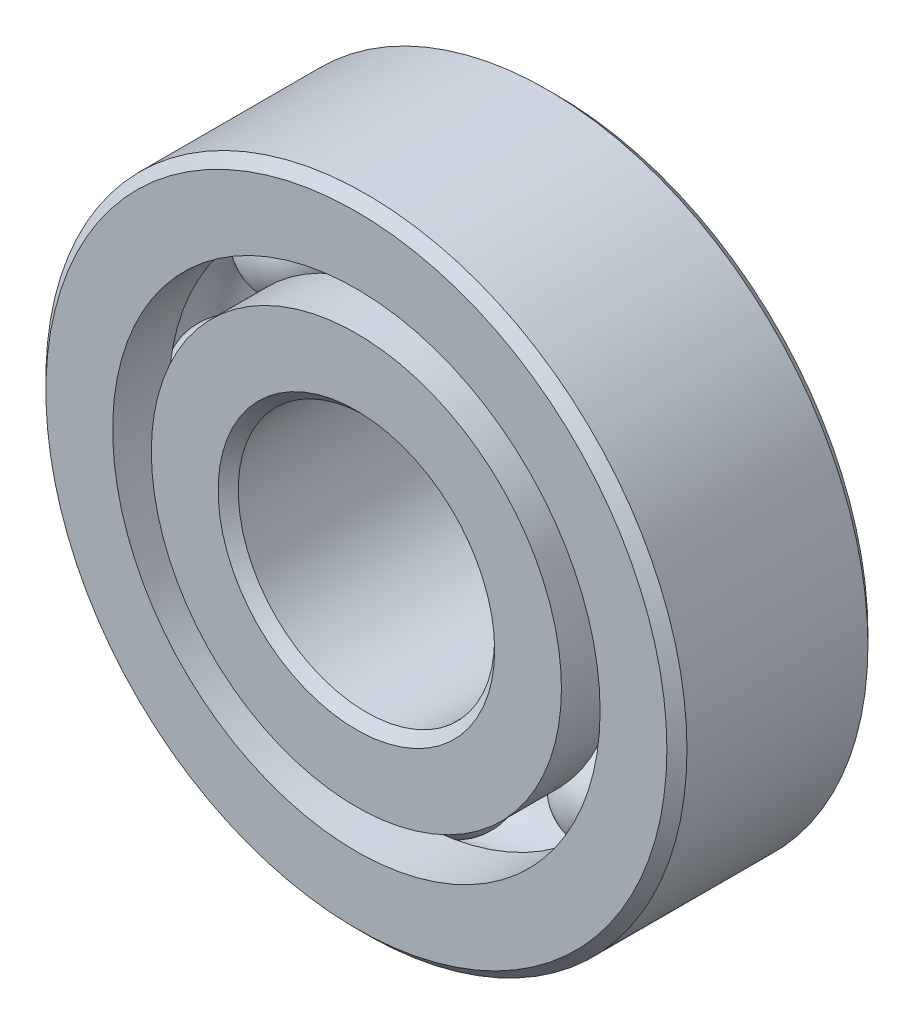
ISO-10303-21;
HEADER;
FILE_DESCRIPTION(('STEP AP214'),'2;1');
FILE_NAME('part.step','',(''),(''),'','','');
FILE_SCHEMA(('AUTOMOTIVE_DESIGN { 1 0 10303 214 1 1 1 1 }'));
ENDSEC;
DATA;
#1=APPLICATION_CONTEXT('core data for automotive mechanical design processes');
#2=APPLICATION_PROTOCOL_DEFINITION('international standard','automotive_design',2000,#1);
#3=PRODUCT_CONTEXT('',#1,'mechanical');
#4=PRODUCT('Part','Part','',(#3));
#5=PRODUCT_RELATED_PRODUCT_CATEGORY('part','',(#4));
#6=PRODUCT_DEFINITION_FORMATION('','',#4);
#7=PRODUCT_DEFINITION_CONTEXT('part definition',#1,'design');
#8=PRODUCT_DEFINITION('design','',#6,#7);
#9=PRODUCT_DEFINITION_SHAPE('','',#8);
#10=(LENGTH_UNIT() NAMED_UNIT(*) SI_UNIT(.MILLI.,.METRE.));
#11=(NAMED_UNIT(*) PLANE_ANGLE_UNIT() SI_UNIT($,.RADIAN.));
#12=(NAMED_UNIT(*) SI_UNIT($,.STERADIAN.) SOLID_ANGLE_UNIT());
#13=UNCERTAINTY_MEASURE_WITH_UNIT(LENGTH_MEASURE(1.E-05),#10,'distance_accuracy_value','');
#14=(GEOMETRIC_REPRESENTATION_CONTEXT(3) GLOBAL_UNCERTAINTY_ASSIGNED_CONTEXT((#13)) GLOBAL_UNIT_ASSIGNED_CONTEXT((#10,
#11,#12)) REPRESENTATION_CONTEXT('',''));
#15=CARTESIAN_POINT('',(0.,0.,0.));
#16=DIRECTION('',(0.,0.,1.));
#17=DIRECTION('',(1.,0.,0.));
#18=AXIS2_PLACEMENT_3D('',#15,#16,#17);
#19=CARTESIAN_POINT('',(-3.92886205296771,3.9288620529678,0.));
#20=DIRECTION('',(0.,0.,1.));
#21=DIRECTION('',(-0.707106781186539,0.707106781186556,0.));
#22=AXIS2_PLACEMENT_3D('',#19,#20,#21);
#23=SPHERICAL_SURFACE('',#22,1.20554465033679);
#24=CARTESIAN_POINT('',(-3.92886205296771,3.9288620529678,1.20554465033679));
#25=VERTEX_POINT('',#24);
#26=VERTEX_LOOP('',#25);
#27=FACE_BOUND('',#26,.T.);
#28=ADVANCED_FACE('F42',(#27),#23,.T.);
#29=CLOSED_SHELL('',(#28));
#30=MANIFOLD_SOLID_BREP('B2',#29);
#31=CARTESIAN_POINT('',(-5.55625,0.,0.));
#32=DIRECTION('',(0.,0.,1.));
#33=DIRECTION('',(-1.,0.,0.));
#34=AXIS2_PLACEMENT_3D('',#31,#32,#33);
#35=SPHERICAL_SURFACE('',#34,1.20554465033679);
#36=CARTESIAN_POINT('',(-5.55625,0.,1.20554465033679));
#37=VERTEX_POINT('',#36);
#38=VERTEX_LOOP('',#37);
#39=FACE_BOUND('',#38,.T.);
#40=ADVANCED_FACE('F65',(#39),#35,.T.);
#41=CLOSED_SHELL('',(#40));
#42=MANIFOLD_SOLID_BREP('B6',#41);
#43=CARTESIAN_POINT('',(-3.92886205296779,-3.92886205296772,0.));
#44=DIRECTION('',(0.,0.,1.));
#45=DIRECTION('',(-0.707106781186554,-0.707106781186541,0.));
#46=AXIS2_PLACEMENT_3D('',#43,#44,#45);
#47=SPHERICAL_SURFACE('',#46,1.20554465033679);
#48=CARTESIAN_POINT('',(-3.92886205296779,-3.92886205296772,1.20554465033679));
#49=VERTEX_POINT('',#48);
#50=VERTEX_LOOP('',#49);
#51=FACE_BOUND('',#50,.T.);
#52=ADVANCED_FACE('F88',(#51),#47,.T.);
#53=CLOSED_SHELL('',(#52));
#54=MANIFOLD_SOLID_BREP('B38',#53);
#55=CARTESIAN_POINT('',(0.,-5.55625,0.));
#56=DIRECTION('',(0.,0.,1.));
#57=DIRECTION('',(0.,-1.,0.));
#58=AXIS2_PLACEMENT_3D('',#55,#56,#57);
#59=SPHERICAL_SURFACE('',#58,1.20554465033679);
#60=CARTESIAN_POINT('',(0.,-5.55625,1.20554465033679));
#61=VERTEX_POINT('',#60);
#62=VERTEX_LOOP('',#61);
#63=FACE_BOUND('',#62,.T.);
#64=ADVANCED_FACE('F111',(#63),#59,.T.);
#65=CLOSED_SHELL('',(#64));
#66=MANIFOLD_SOLID_BREP('B61',#65);
#67=CARTESIAN_POINT('',(3.92886205296773,-3.92886205296777,0.));
#68=DIRECTION('',(0.,0.,1.));
#69=DIRECTION('',(0.707106781186544,-0.707106781186551,0.));
#70=AXIS2_PLACEMENT_3D('',#67,#68,#69);
#71=SPHERICAL_SURFACE('',#70,1.20554465033679);
#72=CARTESIAN_POINT('',(3.92886205296773,-3.92886205296777,1.20554465033679));
#73=VERTEX_POINT('',#72);
#74=VERTEX_LOOP('',#73);
#75=FACE_BOUND('',#74,.T.);
#76=ADVANCED_FACE('F134',(#75),#71,.T.);
#77=CLOSED_SHELL('',(#76));
#78=MANIFOLD_SOLID_BREP('B84',#77);
#79=CARTESIAN_POINT('',(5.55625,0.,0.));
#80=DIRECTION('',(0.,0.,1.));
#81=DIRECTION('',(1.,0.,0.));
#82=AXIS2_PLACEMENT_3D('',#79,#80,#81);
#83=SPHERICAL_SURFACE('',#82,1.20554465033679);
#84=CARTESIAN_POINT('',(5.55625,0.,1.20554465033679));
#85=VERTEX_POINT('',#84);
#86=VERTEX_LOOP('',#85);
#87=FACE_BOUND('',#86,.T.);
#88=ADVANCED_FACE('F157',(#87),#83,.T.);
#89=CLOSED_SHELL('',(#88));
#90=MANIFOLD_SOLID_BREP('B107',#89);
#91=CARTESIAN_POINT('',(3.92886205296776,3.92886205296775,0.));
#92=DIRECTION('',(0.,0.,1.));
#93=DIRECTION('',(0.707106781186549,0.707106781186546,0.));
#94=AXIS2_PLACEMENT_3D('',#91,#92,#93);
#95=SPHERICAL_SURFACE('',#94,1.20554465033679);
#96=CARTESIAN_POINT('',(3.92886205296776,3.92886205296775,1.20554465033679));
#97=VERTEX_POINT('',#96);
#98=VERTEX_LOOP('',#97);
#99=FACE_BOUND('',#98,.T.);
#100=ADVANCED_FACE('F180',(#99),#95,.T.);
#101=CLOSED_SHELL('',(#100));
#102=MANIFOLD_SOLID_BREP('B130',#101);
#103=CARTESIAN_POINT('',(0.,5.55625,0.));
#104=DIRECTION('',(0.,0.,1.));
#105=DIRECTION('',(0.,1.,0.));
#106=AXIS2_PLACEMENT_3D('',#103,#104,#105);
#107=SPHERICAL_SURFACE('',#106,1.20554465033679);
#108=CARTESIAN_POINT('',(0.,5.55625,1.20554465033679));
#109=VERTEX_POINT('',#108);
#110=VERTEX_LOOP('',#109);
#111=FACE_BOUND('',#110,.T.);
#112=ADVANCED_FACE('F205',(#111),#107,.T.);
#113=CLOSED_SHELL('',(#112));
#114=MANIFOLD_SOLID_BREP('B153',#113);
#115=CARTESIAN_POINT('',(0.,5.07727857142857,2.4892));
#116=DIRECTION('',(0.,0.,-1.));
#117=DIRECTION('',(-1.,0.,0.));
#118=AXIS2_PLACEMENT_3D('',#115,#116,#117);
#119=PLANE('',#118);
#120=CARTESIAN_POINT('',(0.,0.,2.4892));
#121=DIRECTION('',(0.,0.,1.));
#122=DIRECTION('',(1.,0.,0.));
#123=AXIS2_PLACEMENT_3D('',#120,#121,#122);
#124=CIRCLE('',#123,3.42392);
#125=CARTESIAN_POINT('',(3.42392,0.,2.4892));
#126=VERTEX_POINT('',#125);
#127=EDGE_CURVE('E255',#126,#126,#124,.T.);
#128=ORIENTED_EDGE('',*,*,#127,.F.);
#129=EDGE_LOOP('',(#128));
#130=FACE_BOUND('',#129,.T.);
#131=CARTESIAN_POINT('',(0.,0.,2.4892));
#132=DIRECTION('',(0.,0.,1.));
#133=DIRECTION('',(1.,0.,0.));
#134=AXIS2_PLACEMENT_3D('',#131,#132,#133);
#135=CIRCLE('',#134,5.07727857142857);
#136=CARTESIAN_POINT('',(5.07727857142857,0.,2.4892));
#137=VERTEX_POINT('',#136);
#138=EDGE_CURVE('E204',#137,#137,#135,.T.);
#139=ORIENTED_EDGE('',*,*,#138,.T.);
#140=EDGE_LOOP('',(#139));
#141=FACE_BOUND('',#140,.T.);
#142=ADVANCED_FACE('F227',(#130,#141),#119,.F.);
#143=CARTESIAN_POINT('',(0.,0.,2.4892));
#144=DIRECTION('',(0.,0.,1.));
#145=DIRECTION('',(1.,0.,0.));
#146=AXIS2_PLACEMENT_3D('',#143,#144,#145);
#147=CYLINDRICAL_SURFACE('',#146,5.07727857142857);
#148=ORIENTED_EDGE('',*,*,#138,.F.);
#149=EDGE_LOOP('',(#148));
#150=FACE_BOUND('',#149,.T.);
#151=CARTESIAN_POINT('',(0.,0.,1.10631111111111));
#152=DIRECTION('',(0.,0.,1.));
#153=DIRECTION('',(1.,0.,0.));
#154=AXIS2_PLACEMENT_3D('',#151,#152,#153);
#155=CIRCLE('',#154,5.07727857142857);
#156=CARTESIAN_POINT('',(5.07727857142857,0.,1.10631111111111));
#157=VERTEX_POINT('',#156);
#158=EDGE_CURVE('E233',#157,#157,#155,.T.);
#159=ORIENTED_EDGE('',*,*,#158,.T.);
#160=EDGE_LOOP('',(#159));
#161=FACE_BOUND('',#160,.T.);
#162=ADVANCED_FACE('F262',(#150,#161),#147,.T.);
#163=CARTESIAN_POINT('',(0.,0.,0.));
#164=DIRECTION('',(0.,0.,1.));
#165=DIRECTION('',(1.,0.,0.));
#166=AXIS2_PLACEMENT_3D('',#163,#164,#165);
#167=TOROIDAL_SURFACE('',#166,5.55625,1.20554465033679);
#168=ORIENTED_EDGE('',*,*,#158,.F.);
#169=EDGE_LOOP('',(#168));
#170=FACE_BOUND('',#169,.T.);
#171=CARTESIAN_POINT('',(0.,0.,-1.10631111111112));
#172=DIRECTION('',(0.,0.,1.));
#173=DIRECTION('',(1.,0.,0.));
#174=AXIS2_PLACEMENT_3D('',#171,#172,#173);
#175=CIRCLE('',#174,5.07727857142857);
#176=CARTESIAN_POINT('',(5.07727857142857,0.,-1.10631111111112));
#177=VERTEX_POINT('',#176);
#178=EDGE_CURVE('E237',#177,#177,#175,.T.);
#179=ORIENTED_EDGE('',*,*,#178,.T.);
#180=EDGE_LOOP('',(#179));
#181=FACE_BOUND('',#180,.T.);
#182=ADVANCED_FACE('F266',(#170,#181),#167,.F.);
#183=CARTESIAN_POINT('',(0.,0.,2.4892));
#184=DIRECTION('',(0.,0.,1.));
#185=DIRECTION('',(1.,0.,0.));
#186=AXIS2_PLACEMENT_3D('',#183,#184,#185);
#187=CYLINDRICAL_SURFACE('',#186,5.07727857142857);
#188=ORIENTED_EDGE('',*,*,#178,.F.);
#189=EDGE_LOOP('',(#188));
#190=FACE_BOUND('',#189,.T.);
#191=CARTESIAN_POINT('',(0.,0.,-2.4892));
#192=DIRECTION('',(0.,0.,1.));
#193=DIRECTION('',(1.,0.,0.));
#194=AXIS2_PLACEMENT_3D('',#191,#192,#193);
#195=CIRCLE('',#194,5.07727857142857);
#196=CARTESIAN_POINT('',(5.07727857142857,0.,-2.4892));
#197=VERTEX_POINT('',#196);
#198=EDGE_CURVE('E241',#197,#197,#195,.T.);
#199=ORIENTED_EDGE('',*,*,#198,.T.);
#200=EDGE_LOOP('',(#199));
#201=FACE_BOUND('',#200,.T.);
#202=ADVANCED_FACE('F271',(#190,#201),#187,.T.);
#203=CARTESIAN_POINT('',(0.,3.42392,-2.4892));
#204=DIRECTION('',(0.,0.,1.));
#205=DIRECTION('',(1.,0.,0.));
#206=AXIS2_PLACEMENT_3D('',#203,#204,#205);
#207=PLANE('',#206);
#208=ORIENTED_EDGE('',*,*,#198,.F.);
#209=EDGE_LOOP('',(#208));
#210=FACE_BOUND('',#209,.T.);
#211=CARTESIAN_POINT('',(0.,0.,-2.4892));
#212=DIRECTION('',(0.,0.,1.));
#213=DIRECTION('',(1.,0.,0.));
#214=AXIS2_PLACEMENT_3D('',#211,#212,#213);
#215=CIRCLE('',#214,3.42392);
#216=CARTESIAN_POINT('',(3.42392,0.,-2.4892));
#217=VERTEX_POINT('',#216);
#218=EDGE_CURVE('E246',#217,#217,#215,.T.);
#219=ORIENTED_EDGE('',*,*,#218,.T.);
#220=EDGE_LOOP('',(#219));
#221=FACE_BOUND('',#220,.T.);
#222=ADVANCED_FACE('F277',(#210,#221),#207,.F.);
#223=CARTESIAN_POINT('',(0.,0.,-2.24028));
#224=DIRECTION('',(0.,0.,-1.));
#225=DIRECTION('',(-1.,0.,0.));
#226=AXIS2_PLACEMENT_3D('',#223,#224,#225);
#227=CONICAL_SURFACE('',#226,3.175,0.785398163397453);
#228=ORIENTED_EDGE('',*,*,#218,.F.);
#229=EDGE_LOOP('',(#228));
#230=FACE_BOUND('',#229,.T.);
#231=CARTESIAN_POINT('',(0.,0.,-2.24028));
#232=DIRECTION('',(0.,0.,1.));
#233=DIRECTION('',(1.,0.,0.));
#234=AXIS2_PLACEMENT_3D('',#231,#232,#233);
#235=CIRCLE('',#234,3.175);
#236=CARTESIAN_POINT('',(3.175,0.,-2.24028));
#237=VERTEX_POINT('',#236);
#238=EDGE_CURVE('E249',#237,#237,#235,.T.);
#239=ORIENTED_EDGE('',*,*,#238,.T.);
#240=EDGE_LOOP('',(#239));
#241=FACE_BOUND('',#240,.T.);
#242=ADVANCED_FACE('F281',(#230,#241),#227,.F.);
#243=CARTESIAN_POINT('',(0.,0.,2.4892));
#244=DIRECTION('',(0.,0.,1.));
#245=DIRECTION('',(1.,0.,0.));
#246=AXIS2_PLACEMENT_3D('',#243,#244,#245);
#247=CYLINDRICAL_SURFACE('',#246,3.175);
#248=ORIENTED_EDGE('',*,*,#238,.F.);
#249=EDGE_LOOP('',(#248));
#250=FACE_BOUND('',#249,.T.);
#251=CARTESIAN_POINT('',(0.,0.,2.24028));
#252=DIRECTION('',(0.,0.,1.));
#253=DIRECTION('',(1.,0.,0.));
#254=AXIS2_PLACEMENT_3D('',#251,#252,#253);
#255=CIRCLE('',#254,3.175);
#256=CARTESIAN_POINT('',(3.175,0.,2.24028));
#257=VERTEX_POINT('',#256);
#258=EDGE_CURVE('E252',#257,#257,#255,.T.);
#259=ORIENTED_EDGE('',*,*,#258,.T.);
#260=EDGE_LOOP('',(#259));
#261=FACE_BOUND('',#260,.T.);
#262=ADVANCED_FACE('F285',(#250,#261),#247,.F.);
#263=CARTESIAN_POINT('',(0.,0.,2.4892));
#264=DIRECTION('',(0.,0.,1.));
#265=DIRECTION('',(1.,0.,0.));
#266=AXIS2_PLACEMENT_3D('',#263,#264,#265);
#267=CONICAL_SURFACE('',#266,3.42392,0.785398163397449);
#268=ORIENTED_EDGE('',*,*,#258,.F.);
#269=EDGE_LOOP('',(#268));
#270=FACE_BOUND('',#269,.T.);
#271=ORIENTED_EDGE('',*,*,#127,.T.);
#272=EDGE_LOOP('',(#271));
#273=FACE_BOUND('',#272,.T.);
#274=ADVANCED_FACE('F259',(#270,#273),#267,.F.);
#275=CLOSED_SHELL('',(#142,#162,#182,#202,#222,#242,#262,#274));
#276=MANIFOLD_SOLID_BREP('B176',#275);
#277=CARTESIAN_POINT('',(0.,0.,2.24028));
#278=DIRECTION('',(0.,0.,-1.));
#279=DIRECTION('',(-1.,0.,0.));
#280=AXIS2_PLACEMENT_3D('',#277,#278,#279);
#281=CONICAL_SURFACE('',#280,7.9375,0.785398163397446);
#282=CARTESIAN_POINT('',(0.,0.,2.4892));
#283=DIRECTION('',(0.,0.,1.));
#284=DIRECTION('',(1.,0.,0.));
#285=AXIS2_PLACEMENT_3D('',#282,#283,#284);
#286=CIRCLE('',#285,7.68858);
#287=CARTESIAN_POINT('',(7.68858,0.,2.4892));
#288=VERTEX_POINT('',#287);
#289=EDGE_CURVE('E379',#288,#288,#286,.T.);
#290=ORIENTED_EDGE('',*,*,#289,.F.);
#291=EDGE_LOOP('',(#290));
#292=FACE_BOUND('',#291,.T.);
#293=CARTESIAN_POINT('',(0.,0.,2.24028));
#294=DIRECTION('',(0.,0.,1.));
#295=DIRECTION('',(1.,0.,0.));
#296=AXIS2_PLACEMENT_3D('',#293,#294,#295);
#297=CIRCLE('',#296,7.9375);
#298=CARTESIAN_POINT('',(7.9375,0.,2.24028));
#299=VERTEX_POINT('',#298);
#300=EDGE_CURVE('E226',#299,#299,#297,.T.);
#301=ORIENTED_EDGE('',*,*,#300,.T.);
#302=EDGE_LOOP('',(#301));
#303=FACE_BOUND('',#302,.T.);
#304=ADVANCED_FACE('F351',(#292,#303),#281,.T.);
#305=CARTESIAN_POINT('',(0.,0.,2.4892));
#306=DIRECTION('',(0.,0.,1.));
#307=DIRECTION('',(1.,0.,0.));
#308=AXIS2_PLACEMENT_3D('',#305,#306,#307);
#309=CYLINDRICAL_SURFACE('',#308,7.9375);
#310=ORIENTED_EDGE('',*,*,#300,.F.);
#311=EDGE_LOOP('',(#310));
#312=FACE_BOUND('',#311,.T.);
#313=CARTESIAN_POINT('',(0.,0.,-2.24028));
#314=DIRECTION('',(0.,0.,1.));
#315=DIRECTION('',(1.,0.,0.));
#316=AXIS2_PLACEMENT_3D('',#313,#314,#315);
#317=CIRCLE('',#316,7.9375);
#318=CARTESIAN_POINT('',(7.9375,0.,-2.24028));
#319=VERTEX_POINT('',#318);
#320=EDGE_CURVE('E357',#319,#319,#317,.T.);
#321=ORIENTED_EDGE('',*,*,#320,.T.);
#322=EDGE_LOOP('',(#321));
#323=FACE_BOUND('',#322,.T.);
#324=ADVANCED_FACE('F386',(#312,#323),#309,.T.);
#325=CARTESIAN_POINT('',(0.,0.,-2.4892));
#326=DIRECTION('',(0.,0.,1.));
#327=DIRECTION('',(1.,0.,0.));
#328=AXIS2_PLACEMENT_3D('',#325,#326,#327);
#329=CONICAL_SURFACE('',#328,7.68858,0.785398163397445);
#330=ORIENTED_EDGE('',*,*,#320,.F.);
#331=EDGE_LOOP('',(#330));
#332=FACE_BOUND('',#331,.T.);
#333=CARTESIAN_POINT('',(0.,0.,-2.4892));
#334=DIRECTION('',(0.,0.,1.));
#335=DIRECTION('',(1.,0.,0.));
#336=AXIS2_PLACEMENT_3D('',#333,#334,#335);
#337=CIRCLE('',#336,7.68858);
#338=CARTESIAN_POINT('',(7.68858,0.,-2.4892));
#339=VERTEX_POINT('',#338);
#340=EDGE_CURVE('E361',#339,#339,#337,.T.);
#341=ORIENTED_EDGE('',*,*,#340,.T.);
#342=EDGE_LOOP('',(#341));
#343=FACE_BOUND('',#342,.T.);
#344=ADVANCED_FACE('F390',(#332,#343),#329,.T.);
#345=CARTESIAN_POINT('',(0.,7.68858,-2.4892));
#346=DIRECTION('',(0.,0.,1.));
#347=DIRECTION('',(1.,0.,0.));
#348=AXIS2_PLACEMENT_3D('',#345,#346,#347);
#349=PLANE('',#348);
#350=ORIENTED_EDGE('',*,*,#340,.F.);
#351=EDGE_LOOP('',(#350));
#352=FACE_BOUND('',#351,.T.);
#353=CARTESIAN_POINT('',(0.,0.,-2.4892));
#354=DIRECTION('',(0.,0.,1.));
#355=DIRECTION('',(1.,0.,0.));
#356=AXIS2_PLACEMENT_3D('',#353,#354,#355);
#357=CIRCLE('',#356,6.03522142857143);
#358=CARTESIAN_POINT('',(6.03522142857143,0.,-2.4892));
#359=VERTEX_POINT('',#358);
#360=EDGE_CURVE('E365',#359,#359,#357,.T.);
#361=ORIENTED_EDGE('',*,*,#360,.T.);
#362=EDGE_LOOP('',(#361));
#363=FACE_BOUND('',#362,.T.);
#364=ADVANCED_FACE('F395',(#352,#363),#349,.F.);
#365=CARTESIAN_POINT('',(0.,0.,2.4892));
#366=DIRECTION('',(0.,0.,1.));
#367=DIRECTION('',(1.,0.,0.));
#368=AXIS2_PLACEMENT_3D('',#365,#366,#367);
#369=CYLINDRICAL_SURFACE('',#368,6.03522142857143);
#370=ORIENTED_EDGE('',*,*,#360,.F.);
#371=EDGE_LOOP('',(#370));
#372=FACE_BOUND('',#371,.T.);
#373=CARTESIAN_POINT('',(0.,0.,-1.10631111111111));
#374=DIRECTION('',(0.,0.,1.));
#375=DIRECTION('',(1.,0.,0.));
#376=AXIS2_PLACEMENT_3D('',#373,#374,#375);
#377=CIRCLE('',#376,6.03522142857143);
#378=CARTESIAN_POINT('',(6.03522142857143,0.,-1.10631111111111));
#379=VERTEX_POINT('',#378);
#380=EDGE_CURVE('E370',#379,#379,#377,.T.);
#381=ORIENTED_EDGE('',*,*,#380,.T.);
#382=EDGE_LOOP('',(#381));
#383=FACE_BOUND('',#382,.T.);
#384=ADVANCED_FACE('F401',(#372,#383),#369,.F.);
#385=CARTESIAN_POINT('',(0.,0.,0.));
#386=DIRECTION('',(0.,0.,1.));
#387=DIRECTION('',(1.,0.,0.));
#388=AXIS2_PLACEMENT_3D('',#385,#386,#387);
#389=TOROIDAL_SURFACE('',#388,5.55625,1.20554465033679);
#390=ORIENTED_EDGE('',*,*,#380,.F.);
#391=EDGE_LOOP('',(#390));
#392=FACE_BOUND('',#391,.T.);
#393=CARTESIAN_POINT('',(0.,0.,1.10631111111111));
#394=DIRECTION('',(0.,0.,1.));
#395=DIRECTION('',(1.,0.,0.));
#396=AXIS2_PLACEMENT_3D('',#393,#394,#395);
#397=CIRCLE('',#396,6.03522142857143);
#398=CARTESIAN_POINT('',(6.03522142857143,0.,1.10631111111111));
#399=VERTEX_POINT('',#398);
#400=EDGE_CURVE('E373',#399,#399,#397,.T.);
#401=ORIENTED_EDGE('',*,*,#400,.T.);
#402=EDGE_LOOP('',(#401));
#403=FACE_BOUND('',#402,.T.);
#404=ADVANCED_FACE('F405',(#392,#403),#389,.F.);
#405=CARTESIAN_POINT('',(0.,0.,2.4892));
#406=DIRECTION('',(0.,0.,1.));
#407=DIRECTION('',(1.,0.,0.));
#408=AXIS2_PLACEMENT_3D('',#405,#406,#407);
#409=CYLINDRICAL_SURFACE('',#408,6.03522142857143);
#410=ORIENTED_EDGE('',*,*,#400,.F.);
#411=EDGE_LOOP('',(#410));
#412=FACE_BOUND('',#411,.T.);
#413=CARTESIAN_POINT('',(0.,0.,2.4892));
#414=DIRECTION('',(0.,0.,1.));
#415=DIRECTION('',(1.,0.,0.));
#416=AXIS2_PLACEMENT_3D('',#413,#414,#415);
#417=CIRCLE('',#416,6.03522142857143);
#418=CARTESIAN_POINT('',(6.03522142857143,0.,2.4892));
#419=VERTEX_POINT('',#418);
#420=EDGE_CURVE('E376',#419,#419,#417,.T.);
#421=ORIENTED_EDGE('',*,*,#420,.T.);
#422=EDGE_LOOP('',(#421));
#423=FACE_BOUND('',#422,.T.);
#424=ADVANCED_FACE('F409',(#412,#423),#409,.F.);
#425=CARTESIAN_POINT('',(0.,7.68858,2.4892));
#426=DIRECTION('',(0.,0.,-1.));
#427=DIRECTION('',(-1.,0.,0.));
#428=AXIS2_PLACEMENT_3D('',#425,#426,#427);
#429=PLANE('',#428);
#430=ORIENTED_EDGE('',*,*,#420,.F.);
#431=EDGE_LOOP('',(#430));
#432=FACE_BOUND('',#431,.T.);
#433=ORIENTED_EDGE('',*,*,#289,.T.);
#434=EDGE_LOOP('',(#433));
#435=FACE_BOUND('',#434,.T.);
#436=ADVANCED_FACE('F383',(#432,#435),#429,.F.);
#437=CLOSED_SHELL('',(#304,#324,#344,#364,#384,#404,#424,#436));
#438=MANIFOLD_SOLID_BREP('B199',#437);
#439=ADVANCED_BREP_SHAPE_REPRESENTATION('',(#18,#30,#42,#54,#66,#78,#90,#102,#114,#276,#438),#14);
#440=SHAPE_DEFINITION_REPRESENTATION(#9,#439);
ENDSEC;
END-ISO-10303-21;
